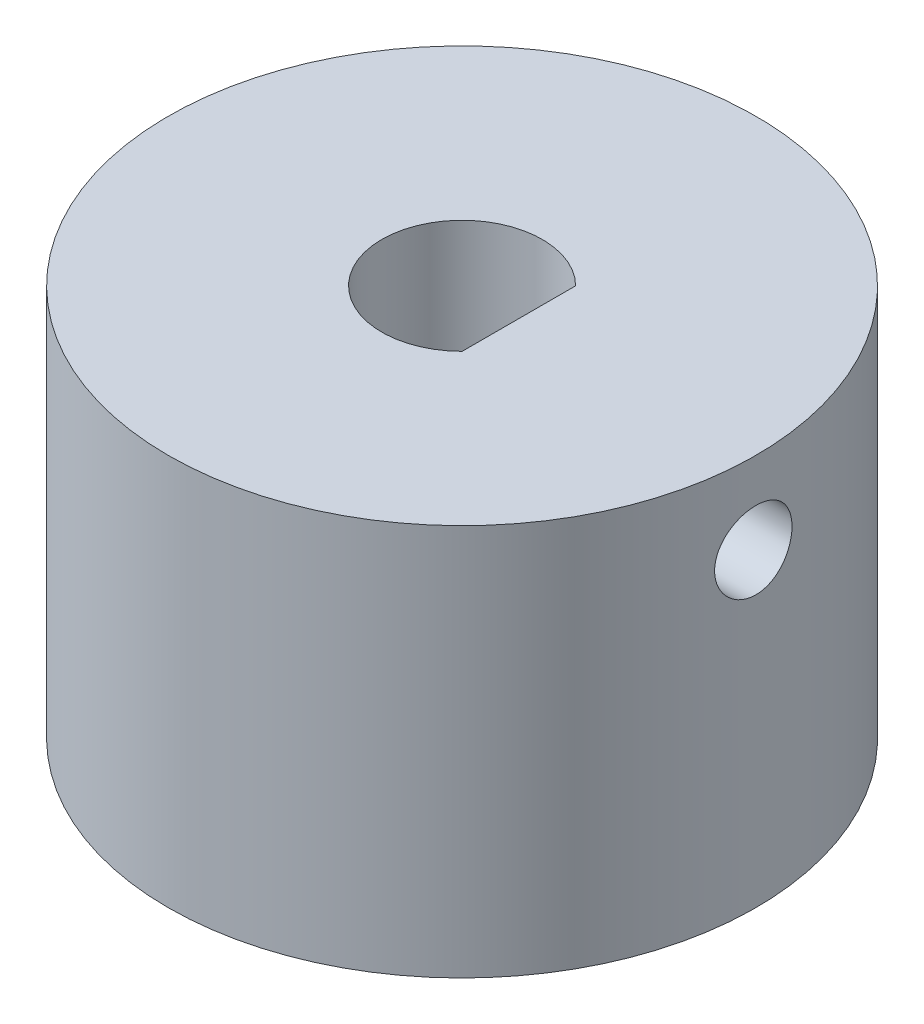
ISO-10303-21;
HEADER;
FILE_DESCRIPTION(('STEP AP214'),'2;1');
FILE_NAME('part.step','',(''),(''),'','','');
FILE_SCHEMA(('AUTOMOTIVE_DESIGN { 1 0 10303 214 1 1 1 1 }'));
ENDSEC;
DATA;
#1=APPLICATION_CONTEXT('core data for automotive mechanical design processes');
#2=APPLICATION_PROTOCOL_DEFINITION('international standard','automotive_design',2000,#1);
#3=PRODUCT_CONTEXT('',#1,'mechanical');
#4=PRODUCT('Part','Part','',(#3));
#5=PRODUCT_RELATED_PRODUCT_CATEGORY('part','',(#4));
#6=PRODUCT_DEFINITION_FORMATION('','',#4);
#7=PRODUCT_DEFINITION_CONTEXT('part definition',#1,'design');
#8=PRODUCT_DEFINITION('design','',#6,#7);
#9=PRODUCT_DEFINITION_SHAPE('','',#8);
#10=(LENGTH_UNIT() NAMED_UNIT(*) SI_UNIT(.MILLI.,.METRE.));
#11=(NAMED_UNIT(*) PLANE_ANGLE_UNIT() SI_UNIT($,.RADIAN.));
#12=(NAMED_UNIT(*) SI_UNIT($,.STERADIAN.) SOLID_ANGLE_UNIT());
#13=UNCERTAINTY_MEASURE_WITH_UNIT(LENGTH_MEASURE(1.E-05),#10,'distance_accuracy_value','');
#14=(GEOMETRIC_REPRESENTATION_CONTEXT(3) GLOBAL_UNCERTAINTY_ASSIGNED_CONTEXT((#13)) GLOBAL_UNIT_ASSIGNED_CONTEXT((#10,
#11,#12)) REPRESENTATION_CONTEXT('',''));
#15=CARTESIAN_POINT('',(0.,0.,0.));
#16=DIRECTION('',(0.,0.,1.));
#17=DIRECTION('',(1.,0.,0.));
#18=AXIS2_PLACEMENT_3D('',#15,#16,#17);
#19=CARTESIAN_POINT('',(0.,6.35,0.));
#20=DIRECTION('',(0.,-1.,0.));
#21=DIRECTION('',(0.,0.,-1.));
#22=AXIS2_PLACEMENT_3D('',#19,#20,#21);
#23=CYLINDRICAL_SURFACE('',#22,9.525);
#24=CARTESIAN_POINT('',(-9.525,-4.64327893654524,0.));
#25=CARTESIAN_POINT('',(-9.52499898000387,-4.64327597757995,-0.070119361420799));
#26=CARTESIAN_POINT('',(-9.52421755079716,-4.63737843845429,-0.140281761941085));
#27=CARTESIAN_POINT('',(-9.52117544938951,-4.61394633356367,-0.278651998259801));
#28=CARTESIAN_POINT('',(-9.5189132586053,-4.59639982102331,-0.346857752398512));
#29=CARTESIAN_POINT('',(-9.51316432568596,-4.55019757005412,-0.479291644593294));
#30=CARTESIAN_POINT('',(-9.50967843338071,-4.5215495399189,-0.543522506790798));
#31=CARTESIAN_POINT('',(-9.50186917113072,-4.45397484105892,-0.666253373171978));
#32=CARTESIAN_POINT('',(-9.4975459380103,-4.41504985124705,-0.724754311296152));
#33=CARTESIAN_POINT('',(-9.48851479733618,-4.32777330707703,-0.834732109893633));
#34=CARTESIAN_POINT('',(-9.48380492771155,-4.27937169394094,-0.88616908751964));
#35=CARTESIAN_POINT('',(-9.47454704845513,-4.17462341417308,-0.980215211843802));
#36=CARTESIAN_POINT('',(-9.46999904733503,-4.11827633050744,-1.02282389488125));
#37=CARTESIAN_POINT('',(-9.46156062843987,-3.99897509095647,-1.09815425289763));
#38=CARTESIAN_POINT('',(-9.45767274131605,-3.93599694415904,-1.13083824123511));
#39=CARTESIAN_POINT('',(-9.45102089795411,-3.80538579627661,-1.18515071867665));
#40=CARTESIAN_POINT('',(-9.44825689450734,-3.73775299084981,-1.20677967215657));
#41=CARTESIAN_POINT('',(-9.44418467372678,-3.60016783959299,-1.23824621092575));
#42=CARTESIAN_POINT('',(-9.44286811326588,-3.53023120602125,-1.24815139815386));
#43=CARTESIAN_POINT('',(-9.44181437213114,-3.38967689876609,-1.25609847694257));
#44=CARTESIAN_POINT('',(-9.44207712121197,-3.31905925551246,-1.25414089614136));
#45=CARTESIAN_POINT('',(-9.4441446769632,-3.17962022207413,-1.23847343764297));
#46=CARTESIAN_POINT('',(-9.4459396856664,-3.11079027589442,-1.22483823019968));
#47=CARTESIAN_POINT('',(-9.45085422206088,-2.97640396977336,-1.18631917165234));
#48=CARTESIAN_POINT('',(-9.45397377926426,-2.91084768280834,-1.16143506991244));
#49=CARTESIAN_POINT('',(-9.46119695722442,-2.78463882004114,-1.10104498292755));
#50=CARTESIAN_POINT('',(-9.46530355754372,-2.7240018499055,-1.06550675443204));
#51=CARTESIAN_POINT('',(-9.47403584889613,-2.60952395947186,-0.98484025300991));
#52=CARTESIAN_POINT('',(-9.4786615662499,-2.5556833840642,-0.939711493713132));
#53=CARTESIAN_POINT('',(-9.48795438292629,-2.45589336764166,-0.840732128408872));
#54=CARTESIAN_POINT('',(-9.49262152722599,-2.41000770634048,-0.786817200278248));
#55=CARTESIAN_POINT('',(-9.501438155028,-2.32792733965898,-0.672016850931544));
#56=CARTESIAN_POINT('',(-9.50558763710299,-2.29173266099894,-0.611131410496819));
#57=CARTESIAN_POINT('',(-9.51290439100195,-2.23006084491617,-0.484067646171691));
#58=CARTESIAN_POINT('',(-9.51607127555175,-2.20458793188882,-0.417887248257211));
#59=CARTESIAN_POINT('',(-9.52106258155477,-2.16513455661264,-0.282137399670722));
#60=CARTESIAN_POINT('',(-9.52288707278565,-2.15115349701237,-0.2125681253531));
#61=CARTESIAN_POINT('',(-9.52497890989796,-2.1351638972346,-0.0725665568106749));
#62=CARTESIAN_POINT('',(-9.5252576766979,-2.13306754176323,-0.00214445601366318));
#63=CARTESIAN_POINT('',(-9.52425755469649,-2.14067477745916,0.138046806569445));
#64=CARTESIAN_POINT('',(-9.52297870279,-2.15037808913118,0.207815983781706));
#65=CARTESIAN_POINT('',(-9.51901413389544,-2.1812362440983,0.344460077222629));
#66=CARTESIAN_POINT('',(-9.51633359013452,-2.20234898809768,0.411344663575411));
#67=CARTESIAN_POINT('',(-9.50986559538391,-2.255382769397,0.540624114411504));
#68=CARTESIAN_POINT('',(-9.50607810310389,-2.28730420987958,0.60301881130907));
#69=CARTESIAN_POINT('',(-9.49778964993408,-2.36126010455996,0.721938016369161));
#70=CARTESIAN_POINT('',(-9.49328475054737,-2.40335108990835,0.778427088486133));
#71=CARTESIAN_POINT('',(-9.48407713657267,-2.49637160959905,0.883570447050574));
#72=CARTESIAN_POINT('',(-9.47937441324371,-2.547301534807,0.932224386838139));
#73=CARTESIAN_POINT('',(-9.47026569236262,-2.6569420963572,1.02062993895678));
#74=CARTESIAN_POINT('',(-9.46586176441128,-2.71570000184571,1.06032317273964));
#75=CARTESIAN_POINT('',(-9.45788396999624,-2.83910034049621,1.12927665022272));
#76=CARTESIAN_POINT('',(-9.45431008538036,-2.90374264492957,1.15853712208391));
#77=CARTESIAN_POINT('',(-9.44841136576283,-3.0368920325306,1.20570096286519));
#78=CARTESIAN_POINT('',(-9.44608297416192,-3.10538748697088,1.22363669717271));
#79=CARTESIAN_POINT('',(-9.44292886239905,-3.24445076776622,1.24774588120469));
#80=CARTESIAN_POINT('',(-9.44210306401893,-3.31501848605432,1.25391994318906));
#81=CARTESIAN_POINT('',(-9.44205008444758,-3.45564210589246,1.25431845701828));
#82=CARTESIAN_POINT('',(-9.44281063178395,-3.52569776045055,1.24863463763576));
#83=CARTESIAN_POINT('',(-9.44581819530608,-3.66384851251181,1.22567355678381));
#84=CARTESIAN_POINT('',(-9.44806521108775,-3.73194361054793,1.20839629846594));
#85=CARTESIAN_POINT('',(-9.45378861020031,-3.86422485021361,1.16276842003611));
#86=CARTESIAN_POINT('',(-9.4572644469954,-3.92841271478849,1.13442272218672));
#87=CARTESIAN_POINT('',(-9.46505468575229,-4.05113594063573,1.06747160892314));
#88=CARTESIAN_POINT('',(-9.46936910274523,-4.10967120055972,1.02886600960063));
#89=CARTESIAN_POINT('',(-9.47839031139319,-4.21989587807361,0.942152308126153));
#90=CARTESIAN_POINT('',(-9.48309977319828,-4.27153136447349,0.89397592441657));
#91=CARTESIAN_POINT('',(-9.49235716973987,-4.36601943477494,0.789631453813257));
#92=CARTESIAN_POINT('',(-9.49690506628642,-4.40886995340262,0.733461492941177));
#93=CARTESIAN_POINT('',(-9.50534829385927,-4.48472770785701,0.614450698515989));
#94=CARTESIAN_POINT('',(-9.50924079500784,-4.51769271488643,0.551582758482531));
#95=CARTESIAN_POINT('',(-9.51590629253989,-4.57254935790014,0.421185629102717));
#96=CARTESIAN_POINT('',(-9.51868049061583,-4.59445288662745,0.353661535006401));
#97=CARTESIAN_POINT('',(-9.52213682763052,-4.62138949890734,0.238165950259979));
#98=CARTESIAN_POINT('',(-9.52320521663505,-4.62958605761487,0.190919228223992));
#99=CARTESIAN_POINT('',(-9.52463714824015,-4.64053176399755,0.0957883631440005));
#100=CARTESIAN_POINT('',(-9.52500069684212,-4.64328095805453,0.0479042255307935));
#101=CARTESIAN_POINT('',(-9.525,-4.64327893654524,0.));
#102=B_SPLINE_CURVE_WITH_KNOTS('',3,(#24,#25,#26,#27,#28,#29,#30,#31,#32,#33,#34,#35,#36,#37,
#38,#39,#40,#41,#42,#43,#44,#45,#46,#47,#48,#49,#50,#51,#52,#53,#54,#55,#56,#57,#58,#59,#60,#61,
#62,#63,#64,#65,#66,#67,#68,#69,#70,#71,#72,#73,#74,#75,#76,#77,#78,#79,#80,#81,#82,#83,#84,#85,
#86,#87,#88,#89,#90,#91,#92,#93,#94,#95,#96,#97,#98,#99,#100,#101),.UNSPECIFIED.,.T.,.F.,(4,2,2,
2,2,2,2,2,2,2,2,2,2,2,2,2,2,2,2,2,2,2,2,2,2,2,2,2,2,2,2,2,2,2,2,2,2,2,4),(0.,0.210183088742693,
0.420582067508404,0.630835217608094,0.841054040577433,1.05241482412773,1.26378670550237,
1.47595146289196,1.68810730739318,1.89903375833246,2.10995082764725,2.31952921410437,
2.5291122703933,2.73933611618543,2.94957062572699,3.16141974004463,3.37326943847302,
3.5852025281154,3.79712460068881,4.00747873356075,4.21782788393288,4.42740612118517,
4.63699217692101,4.84777124152049,5.05855962933033,5.27068401954388,5.48280377038415,
5.69431451919305,5.90581425740001,6.11568396974189,6.32555362503289,6.53533005496999,
6.7451102453948,6.95644461978306,7.16782862032104,7.38010315010753,7.59214896453944,
7.7357433101381,7.87933643309119),.UNSPECIFIED.);
#103=CARTESIAN_POINT('',(-9.525,-4.64327893654524,0.));
#104=VERTEX_POINT('',#103);
#105=EDGE_CURVE('E126',#104,#104,#102,.T.);
#106=ORIENTED_EDGE('',*,*,#105,.T.);
#107=EDGE_LOOP('',(#106));
#108=FACE_BOUND('',#107,.T.);
#109=CARTESIAN_POINT('',(0.,6.35,0.));
#110=DIRECTION('',(0.,1.,0.));
#111=DIRECTION('',(0.,0.,1.));
#112=AXIS2_PLACEMENT_3D('',#109,#110,#111);
#113=CIRCLE('',#112,9.525);
#114=CARTESIAN_POINT('',(0.,6.35,9.525));
#115=VERTEX_POINT('',#114);
#116=EDGE_CURVE('E11',#115,#115,#113,.T.);
#117=ORIENTED_EDGE('',*,*,#116,.F.);
#118=EDGE_LOOP('',(#117));
#119=FACE_BOUND('',#118,.T.);
#120=CARTESIAN_POINT('',(0.,-6.35,0.));
#121=DIRECTION('',(0.,1.,0.));
#122=DIRECTION('',(0.,0.,1.));
#123=AXIS2_PLACEMENT_3D('',#120,#121,#122);
#124=CIRCLE('',#123,9.525);
#125=CARTESIAN_POINT('',(0.,-6.35,9.525));
#126=VERTEX_POINT('',#125);
#127=EDGE_CURVE('E48',#126,#126,#124,.T.);
#128=ORIENTED_EDGE('',*,*,#127,.T.);
#129=EDGE_LOOP('',(#128));
#130=FACE_BOUND('',#129,.T.);
#131=CARTESIAN_POINT('',(9.525,2.43628706423815,0.));
#132=CARTESIAN_POINT('',(9.52499898000387,2.43629002320344,-0.0701193614207989));
#133=CARTESIAN_POINT('',(9.52421755079716,2.44218756232911,-0.140281761941085));
#134=CARTESIAN_POINT('',(9.52117544938951,2.46561966721972,-0.278651998259801));
#135=CARTESIAN_POINT('',(9.5189132586053,2.48316617976008,-0.346857752398512));
#136=CARTESIAN_POINT('',(9.51316432568596,2.52936843072927,-0.479291644593293));
#137=CARTESIAN_POINT('',(9.50967843338071,2.55801646086449,-0.543522506790797));
#138=CARTESIAN_POINT('',(9.50186917113072,2.62559115972447,-0.666253373171977));
#139=CARTESIAN_POINT('',(9.4975459380103,2.66451614953635,-0.724754311296151));
#140=CARTESIAN_POINT('',(9.48851479733618,2.75179269370636,-0.834732109893633));
#141=CARTESIAN_POINT('',(9.48380492771155,2.80019430684245,-0.886169087519639));
#142=CARTESIAN_POINT('',(9.47454704845513,2.90494258661031,-0.980215211843802));
#143=CARTESIAN_POINT('',(9.46999904733503,2.96128967027595,-1.02282389488125));
#144=CARTESIAN_POINT('',(9.46156062843987,3.08059090982692,-1.09815425289763));
#145=CARTESIAN_POINT('',(9.45767274131605,3.14356905662435,-1.13083824123511));
#146=CARTESIAN_POINT('',(9.45102089795411,3.27418020450678,-1.18515071867665));
#147=CARTESIAN_POINT('',(9.44825689450734,3.34181300993358,-1.20677967215657));
#148=CARTESIAN_POINT('',(9.44418467372678,3.4793981611904,-1.23824621092575));
#149=CARTESIAN_POINT('',(9.44286811326588,3.54933479476214,-1.24815139815386));
#150=CARTESIAN_POINT('',(9.44181437213114,3.6898891020173,-1.25609847694257));
#151=CARTESIAN_POINT('',(9.44207712121197,3.76050674527093,-1.25414089614136));
#152=CARTESIAN_POINT('',(9.4441446769632,3.89994577870927,-1.23847343764297));
#153=CARTESIAN_POINT('',(9.44593968566639,3.96877572488897,-1.22483823019968));
#154=CARTESIAN_POINT('',(9.45085422206088,4.10316203101003,-1.18631917165234));
#155=CARTESIAN_POINT('',(9.45397377926426,4.16871831797505,-1.16143506991244));
#156=CARTESIAN_POINT('',(9.46119695722442,4.29492718074225,-1.10104498292755));
#157=CARTESIAN_POINT('',(9.46530355754372,4.35556415087789,-1.06550675443204));
#158=CARTESIAN_POINT('',(9.47403584889613,4.47004204131153,-0.98484025300991));
#159=CARTESIAN_POINT('',(9.4786615662499,4.52388261671919,-0.939711493713133));
#160=CARTESIAN_POINT('',(9.48795438292629,4.62367263314174,-0.840732128408872));
#161=CARTESIAN_POINT('',(9.49262152722599,4.66955829444292,-0.786817200278248));
#162=CARTESIAN_POINT('',(9.501438155028,4.75163866112441,-0.672016850931544));
#163=CARTESIAN_POINT('',(9.50558763710299,4.78783333978445,-0.611131410496818));
#164=CARTESIAN_POINT('',(9.51290439100195,4.84950515586722,-0.48406764617169));
#165=CARTESIAN_POINT('',(9.51607127555175,4.87497806889457,-0.41788724825721));
#166=CARTESIAN_POINT('',(9.52106258155477,4.91443144417075,-0.282137399670722));
#167=CARTESIAN_POINT('',(9.52288707278565,4.92841250377102,-0.2125681253531));
#168=CARTESIAN_POINT('',(9.52497890989796,4.9444021035488,-0.0725665568106744));
#169=CARTESIAN_POINT('',(9.5252576766979,4.94649845902016,-0.0021444560136625));
#170=CARTESIAN_POINT('',(9.52425755469649,4.93889122332423,0.138046806569446));
#171=CARTESIAN_POINT('',(9.52297870279,4.92918791165221,0.207815983781706));
#172=CARTESIAN_POINT('',(9.51901413389544,4.89832975668509,0.344460077222629));
#173=CARTESIAN_POINT('',(9.51633359013452,4.87721701268571,0.411344663575412));
#174=CARTESIAN_POINT('',(9.50986559538391,4.82418323138639,0.540624114411505));
#175=CARTESIAN_POINT('',(9.50607810310389,4.79226179090381,0.603018811309071));
#176=CARTESIAN_POINT('',(9.49778964993408,4.71830589622343,0.721938016369161));
#177=CARTESIAN_POINT('',(9.49328475054737,4.67621491087505,0.778427088486134));
#178=CARTESIAN_POINT('',(9.48407713657267,4.58319439118434,0.883570447050574));
#179=CARTESIAN_POINT('',(9.47937441324371,4.53226446597639,0.932224386838139));
#180=CARTESIAN_POINT('',(9.47026569236262,4.42262390442619,1.02062993895678));
#181=CARTESIAN_POINT('',(9.46586176441128,4.36386599893768,1.06032317273964));
#182=CARTESIAN_POINT('',(9.45788396999624,4.24046566028719,1.12927665022272));
#183=CARTESIAN_POINT('',(9.45431008538036,4.17582335585383,1.15853712208391));
#184=CARTESIAN_POINT('',(9.44841136576283,4.04267396825279,1.20570096286519));
#185=CARTESIAN_POINT('',(9.44608297416192,3.97417851381251,1.22363669717271));
#186=CARTESIAN_POINT('',(9.44292886239905,3.83511523301717,1.24774588120469));
#187=CARTESIAN_POINT('',(9.44210306401893,3.76454751472907,1.25391994318906));
#188=CARTESIAN_POINT('',(9.44205008444758,3.62392389489093,1.25431845701828));
#189=CARTESIAN_POINT('',(9.44281063178395,3.55386824033284,1.24863463763576));
#190=CARTESIAN_POINT('',(9.44581819530608,3.41571748827158,1.22567355678381));
#191=CARTESIAN_POINT('',(9.44806521108775,3.34762239023546,1.20839629846594));
#192=CARTESIAN_POINT('',(9.45378861020031,3.21534115056978,1.16276842003611));
#193=CARTESIAN_POINT('',(9.4572644469954,3.1511532859949,1.13442272218672));
#194=CARTESIAN_POINT('',(9.46505468575229,3.02843006014767,1.06747160892314));
#195=CARTESIAN_POINT('',(9.46936910274523,2.96989480022367,1.02886600960063));
#196=CARTESIAN_POINT('',(9.47839031139319,2.85967012270979,0.942152308126153));
#197=CARTESIAN_POINT('',(9.48309977319828,2.8080346363099,0.893975924416571));
#198=CARTESIAN_POINT('',(9.49235716973987,2.71354656600845,0.789631453813258));
#199=CARTESIAN_POINT('',(9.49690506628642,2.67069604738077,0.733461492941177));
#200=CARTESIAN_POINT('',(9.50534829385927,2.59483829292639,0.614450698515989));
#201=CARTESIAN_POINT('',(9.50924079500784,2.56187328589696,0.551582758482531));
#202=CARTESIAN_POINT('',(9.51590629253989,2.50701664288325,0.421185629102717));
#203=CARTESIAN_POINT('',(9.51868049061583,2.48511311415594,0.353661535006402));
#204=CARTESIAN_POINT('',(9.52213682763052,2.45817650187605,0.238165950259979));
#205=CARTESIAN_POINT('',(9.52320521663505,2.44997994316852,0.190919228223992));
#206=CARTESIAN_POINT('',(9.52463714824015,2.43903423678584,0.0957883631440007));
#207=CARTESIAN_POINT('',(9.52500069684212,2.43628504272886,0.0479042255307936));
#208=CARTESIAN_POINT('',(9.525,2.43628706423815,0.));
#209=B_SPLINE_CURVE_WITH_KNOTS('',3,(#131,#132,#133,#134,#135,#136,#137,#138,#139,#140,#141,
#142,#143,#144,#145,#146,#147,#148,#149,#150,#151,#152,#153,#154,#155,#156,#157,#158,#159,#160,
#161,#162,#163,#164,#165,#166,#167,#168,#169,#170,#171,#172,#173,#174,#175,#176,#177,#178,#179,
#180,#181,#182,#183,#184,#185,#186,#187,#188,#189,#190,#191,#192,#193,#194,#195,#196,#197,#198,
#199,#200,#201,#202,#203,#204,#205,#206,#207,#208),.UNSPECIFIED.,.T.,.F.,(4,2,2,2,2,2,2,2,2,2,2,
2,2,2,2,2,2,2,2,2,2,2,2,2,2,2,2,2,2,2,2,2,2,2,2,2,2,2,4),(0.,0.210183088742693,
0.420582067508404,0.630835217608094,0.841054040577433,1.05241482412773,1.26378670550237,
1.47595146289196,1.68810730739318,1.89903375833246,2.10995082764725,2.31952921410437,
2.5291122703933,2.73933611618543,2.94957062572699,3.16141974004463,3.37326943847302,
3.5852025281154,3.79712460068881,4.00747873356076,4.21782788393288,4.42740612118518,
4.63699217692101,4.84777124152049,5.05855962933033,5.27068401954388,5.48280377038415,
5.69431451919305,5.90581425740001,6.11568396974189,6.32555362503289,6.53533005496999,
6.7451102453948,6.95644461978306,7.16782862032104,7.38010315010753,7.59214896453944,
7.7357433101381,7.87933643309119),.UNSPECIFIED.);
#210=CARTESIAN_POINT('',(9.525,2.43628706423815,0.));
#211=VERTEX_POINT('',#210);
#212=EDGE_CURVE('E127',#211,#211,#209,.T.);
#213=ORIENTED_EDGE('',*,*,#212,.F.);
#214=EDGE_LOOP('',(#213));
#215=FACE_BOUND('',#214,.T.);
#216=ADVANCED_FACE('F39',(#108,#119,#130,#215),#23,.T.);
#217=CARTESIAN_POINT('',(0.,6.35,0.));
#218=DIRECTION('',(0.,1.,0.));
#219=DIRECTION('',(0.,0.,1.));
#220=AXIS2_PLACEMENT_3D('',#217,#218,#219);
#221=PLANE('',#220);
#222=CARTESIAN_POINT('',(0.,6.35,0.));
#223=DIRECTION('',(0.,1.,0.));
#224=DIRECTION('',(0.,0.,1.));
#225=AXIS2_PLACEMENT_3D('',#222,#223,#224);
#226=CIRCLE('',#225,2.6035);
#227=CARTESIAN_POINT('',(1.8415,6.35,-1.84040484676606));
#228=VERTEX_POINT('',#227);
#229=CARTESIAN_POINT('',(1.8415,6.35,1.84040484676606));
#230=VERTEX_POINT('',#229);
#231=EDGE_CURVE('E64',#228,#230,#226,.T.);
#232=ORIENTED_EDGE('',*,*,#231,.F.);
#233=DIRECTION('',(0.,0.,-1.));
#234=VECTOR('',#233,1.);
#235=CARTESIAN_POINT('',(1.8415,6.35,-1.84040484676606));
#236=LINE('',#235,#234);
#237=EDGE_CURVE('E110',#230,#228,#236,.T.);
#238=ORIENTED_EDGE('',*,*,#237,.F.);
#239=EDGE_LOOP('',(#232,#238));
#240=FACE_BOUND('',#239,.T.);
#241=ORIENTED_EDGE('',*,*,#116,.T.);
#242=EDGE_LOOP('',(#241));
#243=FACE_BOUND('',#242,.T.);
#244=ADVANCED_FACE('F167',(#240,#243),#221,.T.);
#245=CARTESIAN_POINT('',(0.,-6.35,0.));
#246=DIRECTION('',(0.,1.,0.));
#247=DIRECTION('',(0.,0.,1.));
#248=AXIS2_PLACEMENT_3D('',#245,#246,#247);
#249=PLANE('',#248);
#250=CARTESIAN_POINT('',(0.,-6.35,0.));
#251=DIRECTION('',(0.,-1.,0.));
#252=DIRECTION('',(0.,0.,-1.));
#253=AXIS2_PLACEMENT_3D('',#250,#251,#252);
#254=CIRCLE('',#253,4.050000028);
#255=CARTESIAN_POINT('',(2.449999926,-6.35,3.22490319070201));
#256=VERTEX_POINT('',#255);
#257=CARTESIAN_POINT('',(2.449999926,-6.35,-3.22490319070201));
#258=VERTEX_POINT('',#257);
#259=EDGE_CURVE('E99',#256,#258,#254,.T.);
#260=ORIENTED_EDGE('',*,*,#259,.F.);
#261=DIRECTION('',(0.,0.,1.));
#262=VECTOR('',#261,1.);
#263=CARTESIAN_POINT('',(2.449999926,-6.35,3.22490319070201));
#264=LINE('',#263,#262);
#265=EDGE_CURVE('E56',#258,#256,#264,.T.);
#266=ORIENTED_EDGE('',*,*,#265,.F.);
#267=EDGE_LOOP('',(#260,#266));
#268=FACE_BOUND('',#267,.T.);
#269=ORIENTED_EDGE('',*,*,#127,.F.);
#270=EDGE_LOOP('',(#269));
#271=FACE_BOUND('',#270,.T.);
#272=ADVANCED_FACE('F172',(#268,#271),#249,.F.);
#273=CARTESIAN_POINT('',(0.,-6.84623064174733,0.));
#274=DIRECTION('',(0.,1.,0.));
#275=DIRECTION('',(0.,0.,1.));
#276=AXIS2_PLACEMENT_3D('',#273,#274,#275);
#277=CYLINDRICAL_SURFACE('',#276,2.6035);
#278=CARTESIAN_POINT('',(0.,0.,0.));
#279=DIRECTION('',(0.,1.,0.));
#280=DIRECTION('',(0.,0.,1.));
#281=AXIS2_PLACEMENT_3D('',#278,#279,#280);
#282=CIRCLE('',#281,2.6035);
#283=CARTESIAN_POINT('',(1.8415,0.,1.84040484676606));
#284=VERTEX_POINT('',#283);
#285=CARTESIAN_POINT('',(1.8415,0.,-1.84040484676606));
#286=VERTEX_POINT('',#285);
#287=EDGE_CURVE('E104',#284,#286,#282,.F.);
#288=ORIENTED_EDGE('',*,*,#287,.T.);
#289=DIRECTION('',(0.,1.,0.));
#290=VECTOR('',#289,1.);
#291=CARTESIAN_POINT('',(1.8415,-6.84623064174733,-1.84040484676606));
#292=LINE('',#291,#290);
#293=EDGE_CURVE('E108',#286,#228,#292,.T.);
#294=ORIENTED_EDGE('',*,*,#293,.T.);
#295=ORIENTED_EDGE('',*,*,#231,.T.);
#296=DIRECTION('',(0.,1.,0.));
#297=VECTOR('',#296,1.);
#298=CARTESIAN_POINT('',(1.8415,-6.84623064174733,1.84040484676606));
#299=LINE('',#298,#297);
#300=EDGE_CURVE('E113',#284,#230,#299,.T.);
#301=ORIENTED_EDGE('',*,*,#300,.F.);
#302=EDGE_LOOP('',(#288,#294,#295,#301));
#303=FACE_BOUND('',#302,.T.);
#304=ADVANCED_FACE('F157',(#303),#277,.F.);
#305=CARTESIAN_POINT('',(1.8415,-6.84623064174733,-1.84040484676606));
#306=DIRECTION('',(1.,0.,0.));
#307=DIRECTION('',(0.,0.,-1.));
#308=AXIS2_PLACEMENT_3D('',#305,#306,#307);
#309=PLANE('',#308);
#310=CARTESIAN_POINT('',(1.8415,3.69041206423815,0.));
#311=DIRECTION('',(1.,0.,0.));
#312=DIRECTION('',(0.,0.,-1.));
#313=AXIS2_PLACEMENT_3D('',#310,#311,#312);
#314=CIRCLE('',#313,1.254125);
#315=CARTESIAN_POINT('',(1.8415,3.69041206423815,-1.254125));
#316=VERTEX_POINT('',#315);
#317=EDGE_CURVE('E43',#316,#316,#314,.F.);
#318=ORIENTED_EDGE('',*,*,#317,.F.);
#319=EDGE_LOOP('',(#318));
#320=FACE_BOUND('',#319,.T.);
#321=DIRECTION('',(0.,0.,1.));
#322=VECTOR('',#321,1.);
#323=CARTESIAN_POINT('',(1.8415,0.,-1.84040484676606));
#324=LINE('',#323,#322);
#325=EDGE_CURVE('E107',#286,#284,#324,.T.);
#326=ORIENTED_EDGE('',*,*,#325,.T.);
#327=ORIENTED_EDGE('',*,*,#300,.T.);
#328=ORIENTED_EDGE('',*,*,#237,.T.);
#329=ORIENTED_EDGE('',*,*,#293,.F.);
#330=EDGE_LOOP('',(#326,#327,#328,#329));
#331=FACE_BOUND('',#330,.T.);
#332=ADVANCED_FACE('F154',(#320,#331),#309,.F.);
#333=CARTESIAN_POINT('',(0.,0.,0.));
#334=DIRECTION('',(0.,1.,0.));
#335=DIRECTION('',(0.,0.,1.));
#336=AXIS2_PLACEMENT_3D('',#333,#334,#335);
#337=PLANE('',#336);
#338=CARTESIAN_POINT('',(0.,0.,0.));
#339=DIRECTION('',(0.,1.,0.));
#340=DIRECTION('',(0.,0.,1.));
#341=AXIS2_PLACEMENT_3D('',#338,#339,#340);
#342=CIRCLE('',#341,4.050000028);
#343=CARTESIAN_POINT('',(2.449999926,0.,3.22490319070201));
#344=VERTEX_POINT('',#343);
#345=CARTESIAN_POINT('',(2.449999926,0.,-3.22490319070201));
#346=VERTEX_POINT('',#345);
#347=EDGE_CURVE('E84',#344,#346,#342,.F.);
#348=ORIENTED_EDGE('',*,*,#347,.T.);
#349=DIRECTION('',(0.,0.,1.));
#350=VECTOR('',#349,1.);
#351=CARTESIAN_POINT('',(2.449999926,0.,3.22490319070201));
#352=LINE('',#351,#350);
#353=EDGE_CURVE('E94',#346,#344,#352,.T.);
#354=ORIENTED_EDGE('',*,*,#353,.T.);
#355=EDGE_LOOP('',(#348,#354));
#356=FACE_BOUND('',#355,.T.);
#357=ORIENTED_EDGE('',*,*,#325,.F.);
#358=ORIENTED_EDGE('',*,*,#287,.F.);
#359=EDGE_LOOP('',(#357,#358));
#360=FACE_BOUND('',#359,.T.);
#361=ADVANCED_FACE('F96',(#356,#360),#337,.F.);
#362=CARTESIAN_POINT('',(2.449999926,10.3855669228598,3.22490319070201));
#363=DIRECTION('',(1.,0.,0.));
#364=DIRECTION('',(0.,0.,-1.));
#365=AXIS2_PLACEMENT_3D('',#362,#363,#364);
#366=PLANE('',#365);
#367=DIRECTION('',(0.,-1.,0.));
#368=VECTOR('',#367,1.);
#369=CARTESIAN_POINT('',(2.449999926,10.3855669228598,-3.22490319070201));
#370=LINE('',#369,#368);
#371=EDGE_CURVE('E89',#346,#258,#370,.T.);
#372=ORIENTED_EDGE('',*,*,#371,.T.);
#373=ORIENTED_EDGE('',*,*,#265,.T.);
#374=DIRECTION('',(0.,-1.,0.));
#375=VECTOR('',#374,1.);
#376=CARTESIAN_POINT('',(2.449999926,10.3855669228598,3.22490319070201));
#377=LINE('',#376,#375);
#378=EDGE_CURVE('E87',#344,#256,#377,.T.);
#379=ORIENTED_EDGE('',*,*,#378,.F.);
#380=ORIENTED_EDGE('',*,*,#353,.F.);
#381=EDGE_LOOP('',(#372,#373,#379,#380));
#382=FACE_BOUND('',#381,.T.);
#383=ADVANCED_FACE('F93',(#382),#366,.F.);
#384=CARTESIAN_POINT('',(0.,10.3855669228598,0.));
#385=DIRECTION('',(0.,-1.,0.));
#386=DIRECTION('',(0.,0.,-1.));
#387=AXIS2_PLACEMENT_3D('',#384,#385,#386);
#388=CYLINDRICAL_SURFACE('',#387,4.050000028);
#389=CARTESIAN_POINT('',(-3.85093114858926,-3.38915393654524,-1.254125));
#390=CARTESIAN_POINT('',(-3.85093164267561,-3.45776091363687,-1.25412444232689));
#391=CARTESIAN_POINT('',(-3.8527846294996,-3.52637347144509,-1.24847615585058));
#392=CARTESIAN_POINT('',(-3.85996433164916,-3.66158510249123,-1.2260953964262));
#393=CARTESIAN_POINT('',(-3.86529203610816,-3.72818359674369,-1.20935976726891));
#394=CARTESIAN_POINT('',(-3.87876114443435,-3.85738929464642,-1.1654331209694));
#395=CARTESIAN_POINT('',(-3.88689763624859,-3.92000324162267,-1.13826034718965));
#396=CARTESIAN_POINT('',(-3.90506075801219,-4.03980062154131,-1.07429141237721));
#397=CARTESIAN_POINT('',(-3.9150877102632,-4.09698312598196,-1.03749360997337));
#398=CARTESIAN_POINT('',(-3.93628126660505,-4.20622304648825,-0.953990134317101));
#399=CARTESIAN_POINT('',(-3.94747334308085,-4.25807029011997,-0.907015912615824));
#400=CARTESIAN_POINT('',(-3.9695191441233,-4.35329164622689,-0.805067865680213));
#401=CARTESIAN_POINT('',(-3.98037282215771,-4.39666459770642,-0.750092946131296));
#402=CARTESIAN_POINT('',(-4.0008098139121,-4.47463020124257,-0.632197219193028));
#403=CARTESIAN_POINT('',(-4.0103596335095,-4.50900690357277,-0.569127286389982));
#404=CARTESIAN_POINT('',(-4.02681579434575,-4.56658327916295,-0.437755057162735));
#405=CARTESIAN_POINT('',(-4.03372274498616,-4.58978552938499,-0.369453971319914));
#406=CARTESIAN_POINT('',(-4.04393465844122,-4.62365405813088,-0.231758448001597));
#407=CARTESIAN_POINT('',(-4.04734258413072,-4.63467944768536,-0.162460115138942));
#408=CARTESIAN_POINT('',(-4.05053587223012,-4.64501856859296,-0.0229189967642578));
#409=CARTESIAN_POINT('',(-4.0503220436693,-4.64433491551751,0.0473235743204324));
#410=CARTESIAN_POINT('',(-4.0463678594464,-4.63151270309723,0.184233645859831));
#411=CARTESIAN_POINT('',(-4.0427473269851,-4.61976334232343,0.250941608283944));
#412=CARTESIAN_POINT('',(-4.03253351126482,-4.58578118408748,0.381387650433755));
#413=CARTESIAN_POINT('',(-4.02594003533802,-4.56354770717593,0.445125537382058));
#414=CARTESIAN_POINT('',(-4.0103592280214,-4.50897529116578,0.568726379577876));
#415=CARTESIAN_POINT('',(-4.00134387923275,-4.4765172579605,0.628533074825068));
#416=CARTESIAN_POINT('',(-3.98187066980716,-4.40251232197325,0.741972807739433));
#417=CARTESIAN_POINT('',(-3.9714124497198,-4.36096315287677,0.795604300903357));
#418=CARTESIAN_POINT('',(-3.9496625370224,-4.26795248132284,0.897492439448752));
#419=CARTESIAN_POINT('',(-3.9383542512731,-4.2161547018624,0.94543898871857));
#420=CARTESIAN_POINT('',(-3.91654948828096,-4.10514698573649,1.03205643503917));
#421=CARTESIAN_POINT('',(-3.90605310318291,-4.04593620974102,1.07072628029522));
#422=CARTESIAN_POINT('',(-3.88697788093264,-3.9209209276796,1.1380447005805));
#423=CARTESIAN_POINT('',(-3.87842098466376,-3.85505209815806,1.16658049965926));
#424=CARTESIAN_POINT('',(-3.86445160511336,-3.71911574118675,1.21205881295951));
#425=CARTESIAN_POINT('',(-3.85903801637402,-3.64904969941356,1.22900540331881));
#426=CARTESIAN_POINT('',(-3.85221294467318,-3.50967428923309,1.25023029679058));
#427=CARTESIAN_POINT('',(-3.85065179370562,-3.44044439472597,1.25498265579257));
#428=CARTESIAN_POINT('',(-3.85129320138978,-3.30217225508189,1.25301339674509));
#429=CARTESIAN_POINT('',(-3.85349519130731,-3.23312998316848,1.24629351252857));
#430=CARTESIAN_POINT('',(-3.86126720599282,-3.09921911835316,1.22199384514385));
#431=CARTESIAN_POINT('',(-3.86674040158581,-3.03428772496807,1.20472597520483));
#432=CARTESIAN_POINT('',(-3.88033606749768,-2.9082504614035,1.16018567089682));
#433=CARTESIAN_POINT('',(-3.88845896468319,-2.84714520950686,1.13291162444558));
#434=CARTESIAN_POINT('',(-3.90672386412243,-2.72858400703434,1.068253114186));
#435=CARTESIAN_POINT('',(-3.9169164406385,-2.67127999298902,1.03060470342379));
#436=CARTESIAN_POINT('',(-3.93806664434926,-2.56363019211305,0.946575521124149));
#437=CARTESIAN_POINT('',(-3.94902446625023,-2.51328618594165,0.900192522059248));
#438=CARTESIAN_POINT('',(-3.97100862712806,-2.4188784148784,0.797771146707511));
#439=CARTESIAN_POINT('',(-3.98201969907404,-2.37515244096716,0.741417315622898));
#440=CARTESIAN_POINT('',(-4.00242449417873,-2.29776562746981,0.621906502514301));
#441=CARTESIAN_POINT('',(-4.01181829305537,-2.26410431661919,0.55874983921234));
#442=CARTESIAN_POINT('',(-4.02787550100166,-2.2081260527384,0.427822468032607));
#443=CARTESIAN_POINT('',(-4.03455878128069,-2.18572623828218,0.360089749936));
#444=CARTESIAN_POINT('',(-4.04452943198222,-2.1527079680134,0.221575578904268));
#445=CARTESIAN_POINT('',(-4.0478178439385,-2.14208589875563,0.150795067967641));
#446=CARTESIAN_POINT('',(-4.05056052101703,-2.13321389292334,0.0113067094988058));
#447=CARTESIAN_POINT('',(-4.0501661355382,-2.1344755961488,-0.0573674724954328));
#448=CARTESIAN_POINT('',(-4.04594871566573,-2.14815745054809,-0.193481532853969));
#449=CARTESIAN_POINT('',(-4.04212589796748,-2.16057689649254,-0.260921488953103));
#450=CARTESIAN_POINT('',(-4.03152795955677,-2.19591267633546,-0.391853215996695));
#451=CARTESIAN_POINT('',(-4.02478908623252,-2.21870030430244,-0.455382859329633));
#452=CARTESIAN_POINT('',(-4.00905437889936,-2.27400962162414,-0.577748345856834));
#453=CARTESIAN_POINT('',(-4.00005816128157,-2.30653296562974,-0.636583389017447));
#454=CARTESIAN_POINT('',(-3.98037416344051,-2.3816508705127,-0.750032852658523));
#455=CARTESIAN_POINT('',(-3.96963982528572,-2.42454622063266,-0.804439955168247));
#456=CARTESIAN_POINT('',(-3.94782759402422,-2.51865743495158,-0.905446173948675));
#457=CARTESIAN_POINT('',(-3.93674959981031,-2.56987576700865,-0.952042966023708));
#458=CARTESIAN_POINT('',(-3.91507960465492,-2.68116601945346,-1.03762567033678));
#459=CARTESIAN_POINT('',(-3.90451492676122,-2.7414707881869,-1.07631653715548));
#460=CARTESIAN_POINT('',(-3.88552771545373,-2.86804218324944,-1.14297085841507));
#461=CARTESIAN_POINT('',(-3.87710427786417,-2.93430627709452,-1.17093884332253));
#462=CARTESIAN_POINT('',(-3.86407667975136,-3.06474711835692,-1.21320092873916));
#463=CARTESIAN_POINT('',(-3.85919597595599,-3.12857053114978,-1.228503033517));
#464=CARTESIAN_POINT('',(-3.85262334913003,-3.25797918657862,-1.24896414309805));
#465=CARTESIAN_POINT('',(-3.85093067623079,-3.32356401122431,-1.25412553314894));
#466=CARTESIAN_POINT('',(-3.85093114858926,-3.38915393654524,-1.254125));
#467=B_SPLINE_CURVE_WITH_KNOTS('',3,(#389,#390,#391,#392,#393,#394,#395,#396,#397,#398,#399,
#400,#401,#402,#403,#404,#405,#406,#407,#408,#409,#410,#411,#412,#413,#414,#415,#416,#417,#418,
#419,#420,#421,#422,#423,#424,#425,#426,#427,#428,#429,#430,#431,#432,#433,#434,#435,#436,#437,
#438,#439,#440,#441,#442,#443,#444,#445,#446,#447,#448,#449,#450,#451,#452,#453,#454,#455,#456,
#457,#458,#459,#460,#461,#462,#463,#464,#465,#466),.UNSPECIFIED.,.T.,.F.,(4,2,2,2,2,2,2,2,2,2,2,
2,2,2,2,2,2,2,2,2,2,2,2,2,2,2,2,2,2,2,2,2,2,2,2,2,2,2,4),(0.,0.205578722963786,
0.411215992726571,0.616495447408665,0.821809931565566,1.03340230852848,1.24502365379214,
1.46133609654117,1.67759863114389,1.88729727900608,2.09694908489721,2.29949202505673,
2.50204809332315,2.70705664016621,2.91211635160218,3.125574545355,3.33905692961822,
3.55484562722441,3.77055838888967,3.97774860271841,4.18490750606914,4.38621862719378,
4.58756219554741,4.79459592971079,5.00168253407172,5.21717342165613,5.43265421758458,
5.64652542355289,5.86033099506465,6.06538989875551,6.27043584253164,6.47300309933466,
6.67560480338062,6.88499116939518,7.09443973449897,7.31066531808459,7.5267994444341,
7.72338390855076,7.9199221275246),.UNSPECIFIED.);
#468=CARTESIAN_POINT('',(-3.85093114858926,-3.38915393654524,-1.254125));
#469=VERTEX_POINT('',#468);
#470=EDGE_CURVE('E119',#469,#469,#467,.T.);
#471=ORIENTED_EDGE('',*,*,#470,.T.);
#472=EDGE_LOOP('',(#471));
#473=FACE_BOUND('',#472,.T.);
#474=ORIENTED_EDGE('',*,*,#378,.T.);
#475=ORIENTED_EDGE('',*,*,#259,.T.);
#476=ORIENTED_EDGE('',*,*,#371,.F.);
#477=ORIENTED_EDGE('',*,*,#347,.F.);
#478=EDGE_LOOP('',(#474,#475,#476,#477));
#479=FACE_BOUND('',#478,.T.);
#480=ADVANCED_FACE('F85',(#473,#479),#388,.F.);
#481=CARTESIAN_POINT('',(-9.525,-3.38915393654524,0.));
#482=DIRECTION('',(1.,0.,0.));
#483=DIRECTION('',(0.,0.,-1.));
#484=AXIS2_PLACEMENT_3D('',#481,#482,#483);
#485=CYLINDRICAL_SURFACE('',#484,1.254125);
#486=ORIENTED_EDGE('',*,*,#470,.F.);
#487=EDGE_LOOP('',(#486));
#488=FACE_BOUND('',#487,.T.);
#489=ORIENTED_EDGE('',*,*,#105,.F.);
#490=EDGE_LOOP('',(#489));
#491=FACE_BOUND('',#490,.T.);
#492=ADVANCED_FACE('F130',(#488,#491),#485,.F.);
#493=CARTESIAN_POINT('',(9.525,3.69041206423815,0.));
#494=DIRECTION('',(-1.,0.,0.));
#495=DIRECTION('',(0.,0.,1.));
#496=AXIS2_PLACEMENT_3D('',#493,#494,#495);
#497=CYLINDRICAL_SURFACE('',#496,1.254125);
#498=ORIENTED_EDGE('',*,*,#317,.T.);
#499=EDGE_LOOP('',(#498));
#500=FACE_BOUND('',#499,.T.);
#501=ORIENTED_EDGE('',*,*,#212,.T.);
#502=EDGE_LOOP('',(#501));
#503=FACE_BOUND('',#502,.T.);
#504=ADVANCED_FACE('F134',(#500,#503),#497,.F.);
#505=CLOSED_SHELL('',(#216,#244,#272,#304,#332,#361,#383,#480,#492,#504));
#506=MANIFOLD_SOLID_BREP('B2',#505);
#507=ADVANCED_BREP_SHAPE_REPRESENTATION('',(#18,#506),#14);
#508=SHAPE_DEFINITION_REPRESENTATION(#9,#507);
ENDSEC;
END-ISO-10303-21;
